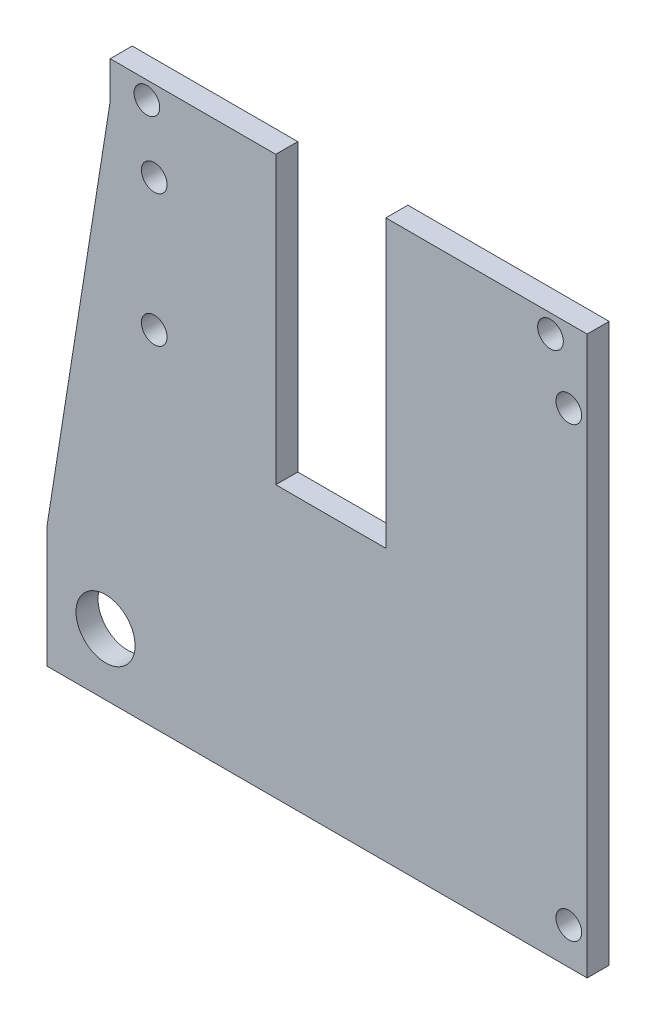
ISO-10303-21;
HEADER;
FILE_DESCRIPTION(('STEP AP214'),'2;1');
FILE_NAME('part.step','',(''),(''),'','','');
FILE_SCHEMA(('AUTOMOTIVE_DESIGN { 1 0 10303 214 1 1 1 1 }'));
ENDSEC;
DATA;
#1=APPLICATION_CONTEXT('core data for automotive mechanical design processes');
#2=APPLICATION_PROTOCOL_DEFINITION('international standard','automotive_design',2000,#1);
#3=PRODUCT_CONTEXT('',#1,'mechanical');
#4=PRODUCT('Part','Part','',(#3));
#5=PRODUCT_RELATED_PRODUCT_CATEGORY('part','',(#4));
#6=PRODUCT_DEFINITION_FORMATION('','',#4);
#7=PRODUCT_DEFINITION_CONTEXT('part definition',#1,'design');
#8=PRODUCT_DEFINITION('design','',#6,#7);
#9=PRODUCT_DEFINITION_SHAPE('','',#8);
#10=(LENGTH_UNIT() NAMED_UNIT(*) SI_UNIT(.MILLI.,.METRE.));
#11=(NAMED_UNIT(*) PLANE_ANGLE_UNIT() SI_UNIT($,.RADIAN.));
#12=(NAMED_UNIT(*) SI_UNIT($,.STERADIAN.) SOLID_ANGLE_UNIT());
#13=UNCERTAINTY_MEASURE_WITH_UNIT(LENGTH_MEASURE(1.E-05),#10,'distance_accuracy_value','');
#14=(GEOMETRIC_REPRESENTATION_CONTEXT(3) GLOBAL_UNCERTAINTY_ASSIGNED_CONTEXT((#13)) GLOBAL_UNIT_ASSIGNED_CONTEXT((#10,
#11,#12)) REPRESENTATION_CONTEXT('',''));
#15=CARTESIAN_POINT('',(0.,0.,0.));
#16=DIRECTION('',(0.,0.,1.));
#17=DIRECTION('',(1.,0.,0.));
#18=AXIS2_PLACEMENT_3D('',#15,#16,#17);
#19=CARTESIAN_POINT('',(0.,0.,-19.));
#20=DIRECTION('',(0.,0.,1.));
#21=DIRECTION('',(0.,-1.,0.));
#22=AXIS2_PLACEMENT_3D('',#19,#20,#21);
#23=PLANE('',#22);
#24=DIRECTION('',(0.156239225816899,0.98771924367005,0.));
#25=VECTOR('',#24,1.);
#26=CARTESIAN_POINT('',(9.80791366190597,100.004051885613,-19.));
#27=LINE('',#26,#25);
#28=CARTESIAN_POINT('',(0.,38.,-19.));
#29=VERTEX_POINT('',#28);
#30=CARTESIAN_POINT('',(8.63620026908051,92.5966683677503,-19.));
#31=VERTEX_POINT('',#30);
#32=EDGE_CURVE('E327',#29,#31,#27,.T.);
#33=ORIENTED_EDGE('',*,*,#32,.T.);
#34=DIRECTION('',(0.,-1.,0.));
#35=VECTOR('',#34,1.);
#36=CARTESIAN_POINT('',(8.63620026908051,92.5966683677504,-19.));
#37=LINE('',#36,#35);
#38=CARTESIAN_POINT('',(8.63620026908051,97.5966683677503,-19.));
#39=VERTEX_POINT('',#38);
#40=EDGE_CURVE('E434',#39,#31,#37,.T.);
#41=ORIENTED_EDGE('',*,*,#40,.F.);
#42=DIRECTION('',(-1.,0.,0.));
#43=VECTOR('',#42,1.);
#44=CARTESIAN_POINT('',(56.6362002690805,97.5966683677503,-19.));
#45=LINE('',#44,#43);
#46=CARTESIAN_POINT('',(31.2,97.5966683677503,-19.));
#47=VERTEX_POINT('',#46);
#48=EDGE_CURVE('E417',#47,#39,#45,.T.);
#49=ORIENTED_EDGE('',*,*,#48,.F.);
#50=DIRECTION('',(0.,1.,0.));
#51=VECTOR('',#50,1.);
#52=CARTESIAN_POINT('',(31.2,92.5966683677504,-19.));
#53=LINE('',#52,#51);
#54=CARTESIAN_POINT('',(31.2,58.5966683677503,-19.));
#55=VERTEX_POINT('',#54);
#56=EDGE_CURVE('E431',#55,#47,#53,.T.);
#57=ORIENTED_EDGE('',*,*,#56,.F.);
#58=DIRECTION('',(-1.,0.,0.));
#59=VECTOR('',#58,1.);
#60=CARTESIAN_POINT('',(56.6362002690805,58.5966683677503,-19.));
#61=LINE('',#60,#59);
#62=CARTESIAN_POINT('',(46.2,58.5966683677503,-19.));
#63=VERTEX_POINT('',#62);
#64=EDGE_CURVE('E436',#63,#55,#61,.T.);
#65=ORIENTED_EDGE('',*,*,#64,.F.);
#66=DIRECTION('',(0.,-1.,0.));
#67=VECTOR('',#66,1.);
#68=CARTESIAN_POINT('',(46.2,92.5966683677504,-19.));
#69=LINE('',#68,#67);
#70=CARTESIAN_POINT('',(46.2,97.5966683677503,-19.));
#71=VERTEX_POINT('',#70);
#72=EDGE_CURVE('E442',#71,#63,#69,.T.);
#73=ORIENTED_EDGE('',*,*,#72,.F.);
#74=DIRECTION('',(-1.,0.,0.));
#75=VECTOR('',#74,1.);
#76=CARTESIAN_POINT('',(56.6362002690805,97.5966683677503,-19.));
#77=LINE('',#76,#75);
#78=CARTESIAN_POINT('',(73.6362002690805,97.5966683677503,-19.));
#79=VERTEX_POINT('',#78);
#80=EDGE_CURVE('E367',#79,#71,#77,.T.);
#81=ORIENTED_EDGE('',*,*,#80,.F.);
#82=DIRECTION('',(0.,1.,0.));
#83=VECTOR('',#82,1.);
#84=CARTESIAN_POINT('',(73.6362002690805,92.5966683677504,-19.));
#85=LINE('',#84,#83);
#86=CARTESIAN_POINT('',(73.6362002690805,21.5966683677503,-19.));
#87=VERTEX_POINT('',#86);
#88=EDGE_CURVE('E353',#87,#79,#85,.T.);
#89=ORIENTED_EDGE('',*,*,#88,.F.);
#90=DIRECTION('',(1.,0.,0.));
#91=VECTOR('',#90,1.);
#92=CARTESIAN_POINT('',(56.6362002690805,21.5966683677503,-19.));
#93=LINE('',#92,#91);
#94=CARTESIAN_POINT('',(0.,21.5966683677503,-19.));
#95=VERTEX_POINT('',#94);
#96=EDGE_CURVE('E364',#95,#87,#93,.T.);
#97=ORIENTED_EDGE('',*,*,#96,.F.);
#98=DIRECTION('',(0.,1.,0.));
#99=VECTOR('',#98,1.);
#100=CARTESIAN_POINT('',(0.,92.5966683677503,-19.));
#101=LINE('',#100,#99);
#102=EDGE_CURVE('E285',#95,#29,#101,.T.);
#103=ORIENTED_EDGE('',*,*,#102,.T.);
#104=EDGE_LOOP('',(#33,#41,#49,#57,#65,#73,#81,#89,#97,#103));
#105=FACE_BOUND('',#104,.T.);
#106=CARTESIAN_POINT('',(7.99999999999999,30.,-19.));
#107=DIRECTION('',(0.,0.,-1.));
#108=DIRECTION('',(0.,1.,0.));
#109=AXIS2_PLACEMENT_3D('',#106,#107,#108);
#110=CIRCLE('',#109,4.025);
#111=CARTESIAN_POINT('',(7.99999999999999,34.025,-19.));
#112=VERTEX_POINT('',#111);
#113=EDGE_CURVE('E379',#112,#112,#110,.T.);
#114=ORIENTED_EDGE('',*,*,#113,.F.);
#115=EDGE_LOOP('',(#114));
#116=FACE_BOUND('',#115,.T.);
#117=CARTESIAN_POINT('',(14.6362002690805,86.5966683677503,-19.));
#118=DIRECTION('',(0.,0.,-1.));
#119=DIRECTION('',(0.,1.,0.));
#120=AXIS2_PLACEMENT_3D('',#117,#118,#119);
#121=CIRCLE('',#120,1.75);
#122=CARTESIAN_POINT('',(14.6362002690805,88.3466683677503,-19.));
#123=VERTEX_POINT('',#122);
#124=EDGE_CURVE('E529',#123,#123,#121,.T.);
#125=ORIENTED_EDGE('',*,*,#124,.F.);
#126=EDGE_LOOP('',(#125));
#127=FACE_BOUND('',#126,.T.);
#128=CARTESIAN_POINT('',(14.6362002690805,68.5966683677503,-19.));
#129=DIRECTION('',(0.,0.,-1.));
#130=DIRECTION('',(0.,1.,0.));
#131=AXIS2_PLACEMENT_3D('',#128,#129,#130);
#132=CIRCLE('',#131,1.75);
#133=CARTESIAN_POINT('',(14.6362002690805,70.3466683677503,-19.));
#134=VERTEX_POINT('',#133);
#135=EDGE_CURVE('E523',#134,#134,#132,.T.);
#136=ORIENTED_EDGE('',*,*,#135,.F.);
#137=EDGE_LOOP('',(#136));
#138=FACE_BOUND('',#137,.T.);
#139=CARTESIAN_POINT('',(71.1362002690805,26.5966683677503,-19.));
#140=DIRECTION('',(0.,0.,-1.));
#141=DIRECTION('',(0.,1.,0.));
#142=AXIS2_PLACEMENT_3D('',#139,#140,#141);
#143=CIRCLE('',#142,1.75);
#144=CARTESIAN_POINT('',(71.1362002690805,28.3466683677503,-19.));
#145=VERTEX_POINT('',#144);
#146=EDGE_CURVE('E517',#145,#145,#143,.T.);
#147=ORIENTED_EDGE('',*,*,#146,.F.);
#148=EDGE_LOOP('',(#147));
#149=FACE_BOUND('',#148,.T.);
#150=CARTESIAN_POINT('',(71.1362002690805,87.5966683677503,-19.));
#151=DIRECTION('',(0.,0.,-1.));
#152=DIRECTION('',(0.,1.,0.));
#153=AXIS2_PLACEMENT_3D('',#150,#151,#152);
#154=CIRCLE('',#153,1.75);
#155=CARTESIAN_POINT('',(71.1362002690805,89.3466683677504,-19.));
#156=VERTEX_POINT('',#155);
#157=EDGE_CURVE('E511',#156,#156,#154,.T.);
#158=ORIENTED_EDGE('',*,*,#157,.F.);
#159=EDGE_LOOP('',(#158));
#160=FACE_BOUND('',#159,.T.);
#161=CARTESIAN_POINT('',(68.6362002690805,95.0966683677503,-19.));
#162=DIRECTION('',(0.,0.,-1.));
#163=DIRECTION('',(0.,1.,0.));
#164=AXIS2_PLACEMENT_3D('',#161,#162,#163);
#165=CIRCLE('',#164,1.75);
#166=CARTESIAN_POINT('',(68.6362002690805,96.8466683677503,-19.));
#167=VERTEX_POINT('',#166);
#168=EDGE_CURVE('E505',#167,#167,#165,.T.);
#169=ORIENTED_EDGE('',*,*,#168,.F.);
#170=EDGE_LOOP('',(#169));
#171=FACE_BOUND('',#170,.T.);
#172=CARTESIAN_POINT('',(13.6362002690805,95.2023708083192,-19.));
#173=DIRECTION('',(0.,0.,-1.));
#174=DIRECTION('',(0.,1.,0.));
#175=AXIS2_PLACEMENT_3D('',#172,#173,#174);
#176=CIRCLE('',#175,1.75);
#177=CARTESIAN_POINT('',(13.6362002690805,96.9523708083192,-19.));
#178=VERTEX_POINT('',#177);
#179=EDGE_CURVE('E496',#178,#178,#176,.T.);
#180=ORIENTED_EDGE('',*,*,#179,.F.);
#181=EDGE_LOOP('',(#180));
#182=FACE_BOUND('',#181,.T.);
#183=ADVANCED_FACE('F268',(#105,#116,#127,#138,#149,#160,#171,#182),#23,.F.);
#184=CARTESIAN_POINT('',(0.,0.,-16.));
#185=DIRECTION('',(0.,0.,1.));
#186=DIRECTION('',(0.,-1.,0.));
#187=AXIS2_PLACEMENT_3D('',#184,#185,#186);
#188=PLANE('',#187);
#189=CARTESIAN_POINT('',(68.6362002690805,95.0966683677503,-16.));
#190=DIRECTION('',(0.,0.,-1.));
#191=DIRECTION('',(0.,1.,0.));
#192=AXIS2_PLACEMENT_3D('',#189,#190,#191);
#193=CIRCLE('',#192,1.75);
#194=CARTESIAN_POINT('',(68.6362002690805,96.8466683677503,-16.));
#195=VERTEX_POINT('',#194);
#196=EDGE_CURVE('E502',#195,#195,#193,.T.);
#197=ORIENTED_EDGE('',*,*,#196,.T.);
#198=EDGE_LOOP('',(#197));
#199=FACE_BOUND('',#198,.T.);
#200=CARTESIAN_POINT('',(71.1362002690805,26.5966683677503,-16.));
#201=DIRECTION('',(0.,0.,-1.));
#202=DIRECTION('',(0.,1.,0.));
#203=AXIS2_PLACEMENT_3D('',#200,#201,#202);
#204=CIRCLE('',#203,1.75);
#205=CARTESIAN_POINT('',(71.1362002690805,28.3466683677503,-16.));
#206=VERTEX_POINT('',#205);
#207=EDGE_CURVE('E514',#206,#206,#204,.T.);
#208=ORIENTED_EDGE('',*,*,#207,.T.);
#209=EDGE_LOOP('',(#208));
#210=FACE_BOUND('',#209,.T.);
#211=CARTESIAN_POINT('',(14.6362002690805,86.5966683677503,-16.));
#212=DIRECTION('',(0.,0.,-1.));
#213=DIRECTION('',(0.,1.,0.));
#214=AXIS2_PLACEMENT_3D('',#211,#212,#213);
#215=CIRCLE('',#214,1.75);
#216=CARTESIAN_POINT('',(14.6362002690805,88.3466683677503,-16.));
#217=VERTEX_POINT('',#216);
#218=EDGE_CURVE('E526',#217,#217,#215,.T.);
#219=ORIENTED_EDGE('',*,*,#218,.T.);
#220=EDGE_LOOP('',(#219));
#221=FACE_BOUND('',#220,.T.);
#222=DIRECTION('',(0.156239225816899,0.98771924367005,0.));
#223=VECTOR('',#222,1.);
#224=CARTESIAN_POINT('',(9.80791366190597,100.004051885613,-16.));
#225=LINE('',#224,#223);
#226=CARTESIAN_POINT('',(0.,38.,-16.));
#227=VERTEX_POINT('',#226);
#228=CARTESIAN_POINT('',(8.63620026908051,92.5966683677503,-16.));
#229=VERTEX_POINT('',#228);
#230=EDGE_CURVE('E375',#227,#229,#225,.T.);
#231=ORIENTED_EDGE('',*,*,#230,.F.);
#232=DIRECTION('',(0.,1.,0.));
#233=VECTOR('',#232,1.);
#234=CARTESIAN_POINT('',(0.,92.5966683677503,-16.));
#235=LINE('',#234,#233);
#236=CARTESIAN_POINT('',(0.,21.5966683677503,-16.));
#237=VERTEX_POINT('',#236);
#238=EDGE_CURVE('E321',#237,#227,#235,.T.);
#239=ORIENTED_EDGE('',*,*,#238,.F.);
#240=DIRECTION('',(1.,0.,0.));
#241=VECTOR('',#240,1.);
#242=CARTESIAN_POINT('',(56.6362002690805,21.5966683677503,-16.));
#243=LINE('',#242,#241);
#244=CARTESIAN_POINT('',(73.6362002690805,21.5966683677503,-16.));
#245=VERTEX_POINT('',#244);
#246=EDGE_CURVE('E398',#237,#245,#243,.T.);
#247=ORIENTED_EDGE('',*,*,#246,.T.);
#248=DIRECTION('',(0.,1.,0.));
#249=VECTOR('',#248,1.);
#250=CARTESIAN_POINT('',(73.6362002690805,92.5966683677504,-16.));
#251=LINE('',#250,#249);
#252=CARTESIAN_POINT('',(73.6362002690805,97.5966683677503,-16.));
#253=VERTEX_POINT('',#252);
#254=EDGE_CURVE('E355',#245,#253,#251,.T.);
#255=ORIENTED_EDGE('',*,*,#254,.T.);
#256=DIRECTION('',(-1.,0.,0.));
#257=VECTOR('',#256,1.);
#258=CARTESIAN_POINT('',(56.6362002690805,97.5966683677503,-16.));
#259=LINE('',#258,#257);
#260=CARTESIAN_POINT('',(46.2,97.5966683677503,-16.));
#261=VERTEX_POINT('',#260);
#262=EDGE_CURVE('E394',#253,#261,#259,.T.);
#263=ORIENTED_EDGE('',*,*,#262,.T.);
#264=DIRECTION('',(0.,-1.,0.));
#265=VECTOR('',#264,1.);
#266=CARTESIAN_POINT('',(46.2,92.5966683677504,-16.));
#267=LINE('',#266,#265);
#268=CARTESIAN_POINT('',(46.2,58.5966683677503,-16.));
#269=VERTEX_POINT('',#268);
#270=EDGE_CURVE('E391',#261,#269,#267,.T.);
#271=ORIENTED_EDGE('',*,*,#270,.T.);
#272=DIRECTION('',(-1.,0.,0.));
#273=VECTOR('',#272,1.);
#274=CARTESIAN_POINT('',(56.6362002690805,58.5966683677503,-16.));
#275=LINE('',#274,#273);
#276=CARTESIAN_POINT('',(31.2,58.5966683677503,-16.));
#277=VERTEX_POINT('',#276);
#278=EDGE_CURVE('E388',#269,#277,#275,.T.);
#279=ORIENTED_EDGE('',*,*,#278,.T.);
#280=DIRECTION('',(0.,1.,0.));
#281=VECTOR('',#280,1.);
#282=CARTESIAN_POINT('',(31.2,92.5966683677504,-16.));
#283=LINE('',#282,#281);
#284=CARTESIAN_POINT('',(31.2,97.5966683677503,-16.));
#285=VERTEX_POINT('',#284);
#286=EDGE_CURVE('E385',#277,#285,#283,.T.);
#287=ORIENTED_EDGE('',*,*,#286,.T.);
#288=DIRECTION('',(-1.,0.,0.));
#289=VECTOR('',#288,1.);
#290=CARTESIAN_POINT('',(56.6362002690805,97.5966683677503,-16.));
#291=LINE('',#290,#289);
#292=CARTESIAN_POINT('',(8.63620026908051,97.5966683677503,-16.));
#293=VERTEX_POINT('',#292);
#294=EDGE_CURVE('E382',#285,#293,#291,.T.);
#295=ORIENTED_EDGE('',*,*,#294,.T.);
#296=DIRECTION('',(0.,-1.,0.));
#297=VECTOR('',#296,1.);
#298=CARTESIAN_POINT('',(8.63620026908051,92.5966683677504,-16.));
#299=LINE('',#298,#297);
#300=EDGE_CURVE('E378',#293,#229,#299,.T.);
#301=ORIENTED_EDGE('',*,*,#300,.T.);
#302=EDGE_LOOP('',(#231,#239,#247,#255,#263,#271,#279,#287,#295,#301));
#303=FACE_BOUND('',#302,.T.);
#304=CARTESIAN_POINT('',(7.99999999999999,30.,-16.));
#305=DIRECTION('',(0.,0.,-1.));
#306=DIRECTION('',(0.,1.,0.));
#307=AXIS2_PLACEMENT_3D('',#304,#305,#306);
#308=CIRCLE('',#307,4.025);
#309=CARTESIAN_POINT('',(7.99999999999999,34.025,-16.));
#310=VERTEX_POINT('',#309);
#311=EDGE_CURVE('E532',#310,#310,#308,.T.);
#312=ORIENTED_EDGE('',*,*,#311,.T.);
#313=EDGE_LOOP('',(#312));
#314=FACE_BOUND('',#313,.T.);
#315=CARTESIAN_POINT('',(14.6362002690805,68.5966683677503,-16.));
#316=DIRECTION('',(0.,0.,-1.));
#317=DIRECTION('',(0.,1.,0.));
#318=AXIS2_PLACEMENT_3D('',#315,#316,#317);
#319=CIRCLE('',#318,1.75);
#320=CARTESIAN_POINT('',(14.6362002690805,70.3466683677503,-16.));
#321=VERTEX_POINT('',#320);
#322=EDGE_CURVE('E520',#321,#321,#319,.T.);
#323=ORIENTED_EDGE('',*,*,#322,.T.);
#324=EDGE_LOOP('',(#323));
#325=FACE_BOUND('',#324,.T.);
#326=CARTESIAN_POINT('',(71.1362002690805,87.5966683677503,-16.));
#327=DIRECTION('',(0.,0.,-1.));
#328=DIRECTION('',(0.,1.,0.));
#329=AXIS2_PLACEMENT_3D('',#326,#327,#328);
#330=CIRCLE('',#329,1.75);
#331=CARTESIAN_POINT('',(71.1362002690805,89.3466683677504,-16.));
#332=VERTEX_POINT('',#331);
#333=EDGE_CURVE('E508',#332,#332,#330,.T.);
#334=ORIENTED_EDGE('',*,*,#333,.T.);
#335=EDGE_LOOP('',(#334));
#336=FACE_BOUND('',#335,.T.);
#337=CARTESIAN_POINT('',(13.6362002690805,95.2023708083192,-16.));
#338=DIRECTION('',(0.,0.,-1.));
#339=DIRECTION('',(0.,1.,0.));
#340=AXIS2_PLACEMENT_3D('',#337,#338,#339);
#341=CIRCLE('',#340,1.75);
#342=CARTESIAN_POINT('',(13.6362002690805,96.9523708083192,-16.));
#343=VERTEX_POINT('',#342);
#344=EDGE_CURVE('E499',#343,#343,#341,.T.);
#345=ORIENTED_EDGE('',*,*,#344,.T.);
#346=EDGE_LOOP('',(#345));
#347=FACE_BOUND('',#346,.T.);
#348=ADVANCED_FACE('F423',(#199,#210,#221,#303,#314,#325,#336,#347),#188,.T.);
#349=CARTESIAN_POINT('',(9.80791366190597,100.004051885613,-19.));
#350=DIRECTION('',(0.98771924367005,-0.156239225816899,0.));
#351=DIRECTION('',(0.156239225816899,0.98771924367005,0.));
#352=AXIS2_PLACEMENT_3D('',#349,#350,#351);
#353=PLANE('',#352);
#354=ORIENTED_EDGE('',*,*,#230,.T.);
#355=DIRECTION('',(0.,0.,1.));
#356=VECTOR('',#355,1.);
#357=CARTESIAN_POINT('',(8.63620026908051,92.5966683677503,-19.));
#358=LINE('',#357,#356);
#359=EDGE_CURVE('E12',#31,#229,#358,.T.);
#360=ORIENTED_EDGE('',*,*,#359,.F.);
#361=ORIENTED_EDGE('',*,*,#32,.F.);
#362=DIRECTION('',(0.,0.,1.));
#363=VECTOR('',#362,1.);
#364=CARTESIAN_POINT('',(0.,38.,-19.));
#365=LINE('',#364,#363);
#366=EDGE_CURVE('E371',#29,#227,#365,.T.);
#367=ORIENTED_EDGE('',*,*,#366,.T.);
#368=EDGE_LOOP('',(#354,#360,#361,#367));
#369=FACE_BOUND('',#368,.T.);
#370=ADVANCED_FACE('F270',(#369),#353,.F.);
#371=CARTESIAN_POINT('',(8.63620026908051,92.5966683677504,-19.));
#372=DIRECTION('',(-1.,0.,0.));
#373=DIRECTION('',(0.,0.,1.));
#374=AXIS2_PLACEMENT_3D('',#371,#372,#373);
#375=PLANE('',#374);
#376=ORIENTED_EDGE('',*,*,#300,.F.);
#377=DIRECTION('',(0.,0.,1.));
#378=VECTOR('',#377,1.);
#379=CARTESIAN_POINT('',(8.63620026908051,97.5966683677503,-19.));
#380=LINE('',#379,#378);
#381=EDGE_CURVE('E277',#39,#293,#380,.T.);
#382=ORIENTED_EDGE('',*,*,#381,.F.);
#383=ORIENTED_EDGE('',*,*,#40,.T.);
#384=ORIENTED_EDGE('',*,*,#359,.T.);
#385=EDGE_LOOP('',(#376,#382,#383,#384));
#386=FACE_BOUND('',#385,.T.);
#387=ADVANCED_FACE('F420',(#386),#375,.T.);
#388=CARTESIAN_POINT('',(56.6362002690805,97.5966683677503,-19.));
#389=DIRECTION('',(0.,1.,0.));
#390=DIRECTION('',(0.,0.,1.));
#391=AXIS2_PLACEMENT_3D('',#388,#389,#390);
#392=PLANE('',#391);
#393=ORIENTED_EDGE('',*,*,#294,.F.);
#394=DIRECTION('',(0.,0.,1.));
#395=VECTOR('',#394,1.);
#396=CARTESIAN_POINT('',(31.2,97.5966683677503,-19.));
#397=LINE('',#396,#395);
#398=EDGE_CURVE('E410',#47,#285,#397,.T.);
#399=ORIENTED_EDGE('',*,*,#398,.F.);
#400=ORIENTED_EDGE('',*,*,#48,.T.);
#401=ORIENTED_EDGE('',*,*,#381,.T.);
#402=EDGE_LOOP('',(#393,#399,#400,#401));
#403=FACE_BOUND('',#402,.T.);
#404=ADVANCED_FACE('F415',(#403),#392,.T.);
#405=CARTESIAN_POINT('',(31.2,92.5966683677504,-19.));
#406=DIRECTION('',(1.,0.,0.));
#407=DIRECTION('',(0.,1.,0.));
#408=AXIS2_PLACEMENT_3D('',#405,#406,#407);
#409=PLANE('',#408);
#410=ORIENTED_EDGE('',*,*,#286,.F.);
#411=DIRECTION('',(0.,0.,1.));
#412=VECTOR('',#411,1.);
#413=CARTESIAN_POINT('',(31.2,58.5966683677503,-19.));
#414=LINE('',#413,#412);
#415=EDGE_CURVE('E408',#55,#277,#414,.T.);
#416=ORIENTED_EDGE('',*,*,#415,.F.);
#417=ORIENTED_EDGE('',*,*,#56,.T.);
#418=ORIENTED_EDGE('',*,*,#398,.T.);
#419=EDGE_LOOP('',(#410,#416,#417,#418));
#420=FACE_BOUND('',#419,.T.);
#421=ADVANCED_FACE('F428',(#420),#409,.T.);
#422=CARTESIAN_POINT('',(56.6362002690805,58.5966683677503,-19.));
#423=DIRECTION('',(0.,1.,0.));
#424=DIRECTION('',(0.,0.,1.));
#425=AXIS2_PLACEMENT_3D('',#422,#423,#424);
#426=PLANE('',#425);
#427=ORIENTED_EDGE('',*,*,#278,.F.);
#428=DIRECTION('',(0.,0.,1.));
#429=VECTOR('',#428,1.);
#430=CARTESIAN_POINT('',(46.2,58.5966683677503,-19.));
#431=LINE('',#430,#429);
#432=EDGE_CURVE('E406',#63,#269,#431,.T.);
#433=ORIENTED_EDGE('',*,*,#432,.F.);
#434=ORIENTED_EDGE('',*,*,#64,.T.);
#435=ORIENTED_EDGE('',*,*,#415,.T.);
#436=EDGE_LOOP('',(#427,#433,#434,#435));
#437=FACE_BOUND('',#436,.T.);
#438=ADVANCED_FACE('F631',(#437),#426,.T.);
#439=CARTESIAN_POINT('',(46.2,92.5966683677504,-19.));
#440=DIRECTION('',(-1.,0.,0.));
#441=DIRECTION('',(0.,0.,1.));
#442=AXIS2_PLACEMENT_3D('',#439,#440,#441);
#443=PLANE('',#442);
#444=ORIENTED_EDGE('',*,*,#270,.F.);
#445=DIRECTION('',(0.,0.,1.));
#446=VECTOR('',#445,1.);
#447=CARTESIAN_POINT('',(46.2,97.5966683677503,-19.));
#448=LINE('',#447,#446);
#449=EDGE_CURVE('E404',#71,#261,#448,.T.);
#450=ORIENTED_EDGE('',*,*,#449,.F.);
#451=ORIENTED_EDGE('',*,*,#72,.T.);
#452=ORIENTED_EDGE('',*,*,#432,.T.);
#453=EDGE_LOOP('',(#444,#450,#451,#452));
#454=FACE_BOUND('',#453,.T.);
#455=ADVANCED_FACE('F621',(#454),#443,.T.);
#456=CARTESIAN_POINT('',(56.6362002690805,97.5966683677503,-19.));
#457=DIRECTION('',(0.,1.,0.));
#458=DIRECTION('',(0.,0.,1.));
#459=AXIS2_PLACEMENT_3D('',#456,#457,#458);
#460=PLANE('',#459);
#461=ORIENTED_EDGE('',*,*,#262,.F.);
#462=DIRECTION('',(0.,0.,1.));
#463=VECTOR('',#462,1.);
#464=CARTESIAN_POINT('',(73.6362002690805,97.5966683677503,-19.));
#465=LINE('',#464,#463);
#466=EDGE_CURVE('E360',#79,#253,#465,.T.);
#467=ORIENTED_EDGE('',*,*,#466,.F.);
#468=ORIENTED_EDGE('',*,*,#80,.T.);
#469=ORIENTED_EDGE('',*,*,#449,.T.);
#470=EDGE_LOOP('',(#461,#467,#468,#469));
#471=FACE_BOUND('',#470,.T.);
#472=ADVANCED_FACE('F446',(#471),#460,.T.);
#473=CARTESIAN_POINT('',(73.6362002690805,92.5966683677504,-19.));
#474=DIRECTION('',(1.,0.,0.));
#475=DIRECTION('',(0.,0.,-1.));
#476=AXIS2_PLACEMENT_3D('',#473,#474,#475);
#477=PLANE('',#476);
#478=ORIENTED_EDGE('',*,*,#254,.F.);
#479=DIRECTION('',(0.,0.,1.));
#480=VECTOR('',#479,1.);
#481=CARTESIAN_POINT('',(73.6362002690805,21.5966683677503,-19.));
#482=LINE('',#481,#480);
#483=EDGE_CURVE('E350',#87,#245,#482,.T.);
#484=ORIENTED_EDGE('',*,*,#483,.F.);
#485=ORIENTED_EDGE('',*,*,#88,.T.);
#486=ORIENTED_EDGE('',*,*,#466,.T.);
#487=EDGE_LOOP('',(#478,#484,#485,#486));
#488=FACE_BOUND('',#487,.T.);
#489=ADVANCED_FACE('F352',(#488),#477,.T.);
#490=CARTESIAN_POINT('',(56.6362002690805,21.5966683677503,-19.));
#491=DIRECTION('',(0.,-1.,0.));
#492=DIRECTION('',(1.,0.,0.));
#493=AXIS2_PLACEMENT_3D('',#490,#491,#492);
#494=PLANE('',#493);
#495=ORIENTED_EDGE('',*,*,#246,.F.);
#496=DIRECTION('',(0.,0.,1.));
#497=VECTOR('',#496,1.);
#498=CARTESIAN_POINT('',(0.,21.5966683677503,-19.));
#499=LINE('',#498,#497);
#500=EDGE_CURVE('E318',#95,#237,#499,.T.);
#501=ORIENTED_EDGE('',*,*,#500,.F.);
#502=ORIENTED_EDGE('',*,*,#96,.T.);
#503=ORIENTED_EDGE('',*,*,#483,.T.);
#504=EDGE_LOOP('',(#495,#501,#502,#503));
#505=FACE_BOUND('',#504,.T.);
#506=ADVANCED_FACE('F369',(#505),#494,.T.);
#507=CARTESIAN_POINT('',(0.,92.5966683677503,-19.));
#508=DIRECTION('',(1.,0.,0.));
#509=DIRECTION('',(0.,1.,0.));
#510=AXIS2_PLACEMENT_3D('',#507,#508,#509);
#511=PLANE('',#510);
#512=ORIENTED_EDGE('',*,*,#238,.T.);
#513=ORIENTED_EDGE('',*,*,#366,.F.);
#514=ORIENTED_EDGE('',*,*,#102,.F.);
#515=ORIENTED_EDGE('',*,*,#500,.T.);
#516=EDGE_LOOP('',(#512,#513,#514,#515));
#517=FACE_BOUND('',#516,.T.);
#518=ADVANCED_FACE('F449',(#517),#511,.F.);
#519=CARTESIAN_POINT('',(7.99999999999999,30.,-19.));
#520=DIRECTION('',(0.,0.,1.));
#521=DIRECTION('',(1.,0.,0.));
#522=AXIS2_PLACEMENT_3D('',#519,#520,#521);
#523=CYLINDRICAL_SURFACE('',#522,4.025);
#524=ORIENTED_EDGE('',*,*,#113,.T.);
#525=EDGE_LOOP('',(#524));
#526=FACE_BOUND('',#525,.T.);
#527=ORIENTED_EDGE('',*,*,#311,.F.);
#528=EDGE_LOOP('',(#527));
#529=FACE_BOUND('',#528,.T.);
#530=ADVANCED_FACE('F451',(#526,#529),#523,.F.);
#531=CARTESIAN_POINT('',(14.6362002690805,86.5966683677503,-19.));
#532=DIRECTION('',(0.,0.,1.));
#533=DIRECTION('',(1.,0.,0.));
#534=AXIS2_PLACEMENT_3D('',#531,#532,#533);
#535=CYLINDRICAL_SURFACE('',#534,1.75);
#536=ORIENTED_EDGE('',*,*,#124,.T.);
#537=EDGE_LOOP('',(#536));
#538=FACE_BOUND('',#537,.T.);
#539=ORIENTED_EDGE('',*,*,#218,.F.);
#540=EDGE_LOOP('',(#539));
#541=FACE_BOUND('',#540,.T.);
#542=ADVANCED_FACE('F457',(#538,#541),#535,.F.);
#543=CARTESIAN_POINT('',(14.6362002690805,68.5966683677503,-19.));
#544=DIRECTION('',(0.,0.,1.));
#545=DIRECTION('',(1.,0.,0.));
#546=AXIS2_PLACEMENT_3D('',#543,#544,#545);
#547=CYLINDRICAL_SURFACE('',#546,1.75);
#548=ORIENTED_EDGE('',*,*,#135,.T.);
#549=EDGE_LOOP('',(#548));
#550=FACE_BOUND('',#549,.T.);
#551=ORIENTED_EDGE('',*,*,#322,.F.);
#552=EDGE_LOOP('',(#551));
#553=FACE_BOUND('',#552,.T.);
#554=ADVANCED_FACE('F471',(#550,#553),#547,.F.);
#555=CARTESIAN_POINT('',(71.1362002690805,26.5966683677503,-19.));
#556=DIRECTION('',(0.,0.,1.));
#557=DIRECTION('',(1.,0.,0.));
#558=AXIS2_PLACEMENT_3D('',#555,#556,#557);
#559=CYLINDRICAL_SURFACE('',#558,1.75);
#560=ORIENTED_EDGE('',*,*,#146,.T.);
#561=EDGE_LOOP('',(#560));
#562=FACE_BOUND('',#561,.T.);
#563=ORIENTED_EDGE('',*,*,#207,.F.);
#564=EDGE_LOOP('',(#563));
#565=FACE_BOUND('',#564,.T.);
#566=ADVANCED_FACE('F475',(#562,#565),#559,.F.);
#567=CARTESIAN_POINT('',(71.1362002690805,87.5966683677503,-19.));
#568=DIRECTION('',(0.,0.,1.));
#569=DIRECTION('',(1.,0.,0.));
#570=AXIS2_PLACEMENT_3D('',#567,#568,#569);
#571=CYLINDRICAL_SURFACE('',#570,1.75);
#572=ORIENTED_EDGE('',*,*,#157,.T.);
#573=EDGE_LOOP('',(#572));
#574=FACE_BOUND('',#573,.T.);
#575=ORIENTED_EDGE('',*,*,#333,.F.);
#576=EDGE_LOOP('',(#575));
#577=FACE_BOUND('',#576,.T.);
#578=ADVANCED_FACE('F479',(#574,#577),#571,.F.);
#579=CARTESIAN_POINT('',(68.6362002690805,95.0966683677503,-19.));
#580=DIRECTION('',(0.,0.,1.));
#581=DIRECTION('',(1.,0.,0.));
#582=AXIS2_PLACEMENT_3D('',#579,#580,#581);
#583=CYLINDRICAL_SURFACE('',#582,1.75);
#584=ORIENTED_EDGE('',*,*,#168,.T.);
#585=EDGE_LOOP('',(#584));
#586=FACE_BOUND('',#585,.T.);
#587=ORIENTED_EDGE('',*,*,#196,.F.);
#588=EDGE_LOOP('',(#587));
#589=FACE_BOUND('',#588,.T.);
#590=ADVANCED_FACE('F483',(#586,#589),#583,.F.);
#591=CARTESIAN_POINT('',(13.6362002690805,95.2023708083192,-19.));
#592=DIRECTION('',(0.,0.,1.));
#593=DIRECTION('',(1.,0.,0.));
#594=AXIS2_PLACEMENT_3D('',#591,#592,#593);
#595=CYLINDRICAL_SURFACE('',#594,1.75);
#596=ORIENTED_EDGE('',*,*,#179,.T.);
#597=EDGE_LOOP('',(#596));
#598=FACE_BOUND('',#597,.T.);
#599=ORIENTED_EDGE('',*,*,#344,.F.);
#600=EDGE_LOOP('',(#599));
#601=FACE_BOUND('',#600,.T.);
#602=ADVANCED_FACE('F487',(#598,#601),#595,.F.);
#603=CLOSED_SHELL('',(#183,#348,#370,#387,#404,#421,#438,#455,#472,#489,#506,#518,#530,#542,
#554,#566,#578,#590,#602));
#604=MANIFOLD_SOLID_BREP('B2',#603);
#605=ADVANCED_BREP_SHAPE_REPRESENTATION('',(#18,#604),#14);
#606=SHAPE_DEFINITION_REPRESENTATION(#9,#605);
ENDSEC;
END-ISO-10303-21;
